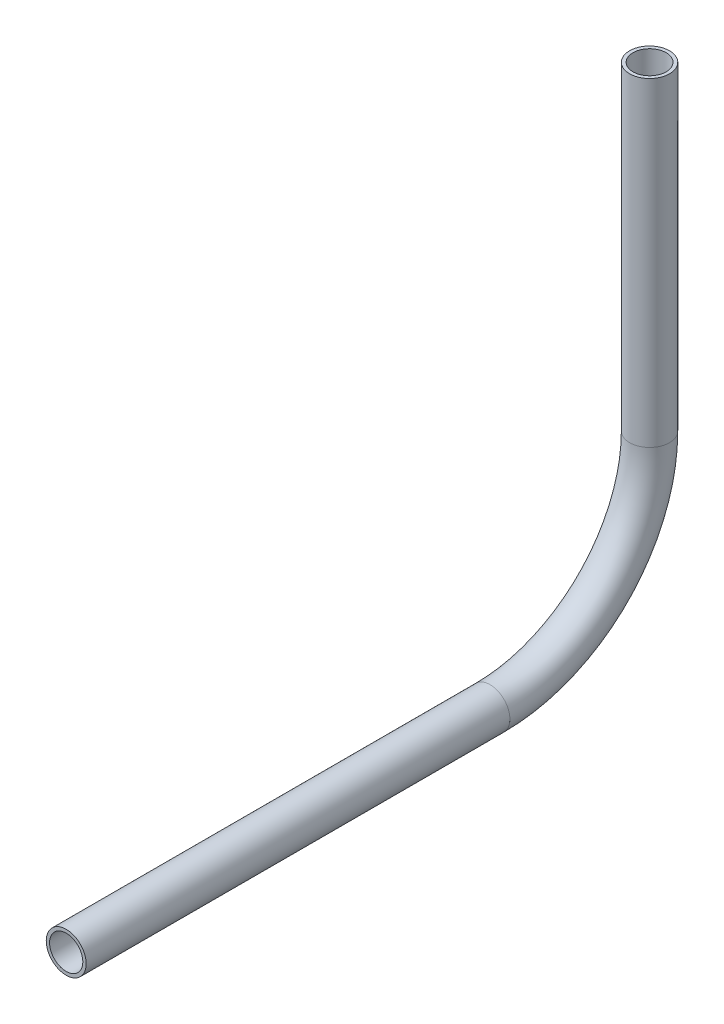
ISO-10303-21;
HEADER;
FILE_DESCRIPTION(('STEP AP214'),'2;1');
FILE_NAME('part.step','',(''),(''),'','','');
FILE_SCHEMA(('AUTOMOTIVE_DESIGN { 1 0 10303 214 1 1 1 1 }'));
ENDSEC;
DATA;
#1=APPLICATION_CONTEXT('core data for automotive mechanical design processes');
#2=APPLICATION_PROTOCOL_DEFINITION('international standard','automotive_design',2000,#1);
#3=PRODUCT_CONTEXT('',#1,'mechanical');
#4=PRODUCT('Part','Part','',(#3));
#5=PRODUCT_RELATED_PRODUCT_CATEGORY('part','',(#4));
#6=PRODUCT_DEFINITION_FORMATION('','',#4);
#7=PRODUCT_DEFINITION_CONTEXT('part definition',#1,'design');
#8=PRODUCT_DEFINITION('design','',#6,#7);
#9=PRODUCT_DEFINITION_SHAPE('','',#8);
#10=(LENGTH_UNIT() NAMED_UNIT(*) SI_UNIT(.MILLI.,.METRE.));
#11=(NAMED_UNIT(*) PLANE_ANGLE_UNIT() SI_UNIT($,.RADIAN.));
#12=(NAMED_UNIT(*) SI_UNIT($,.STERADIAN.) SOLID_ANGLE_UNIT());
#13=UNCERTAINTY_MEASURE_WITH_UNIT(LENGTH_MEASURE(1.E-05),#10,'distance_accuracy_value','');
#14=(GEOMETRIC_REPRESENTATION_CONTEXT(3) GLOBAL_UNCERTAINTY_ASSIGNED_CONTEXT((#13)) GLOBAL_UNIT_ASSIGNED_CONTEXT((#10,
#11,#12)) REPRESENTATION_CONTEXT('',''));
#15=CARTESIAN_POINT('',(0.,0.,0.));
#16=DIRECTION('',(0.,0.,1.));
#17=DIRECTION('',(1.,0.,0.));
#18=AXIS2_PLACEMENT_3D('',#15,#16,#17);
#19=CARTESIAN_POINT('',(0.,599.96001927236,168.273454593785));
#20=DIRECTION('',(0.,0.,1.));
#21=DIRECTION('',(1.,0.,0.));
#22=AXIS2_PLACEMENT_3D('',#19,#20,#21);
#23=CYLINDRICAL_SURFACE('',#22,5.28320000000004);
#24=CARTESIAN_POINT('',(0.,599.96001927236,303.16459571102));
#25=DIRECTION('',(0.,0.,-1.));
#26=DIRECTION('',(-1.,0.,0.));
#27=AXIS2_PLACEMENT_3D('',#24,#25,#26);
#28=CIRCLE('',#27,5.28320000000004);
#29=CARTESIAN_POINT('',(-5.28320000000004,599.96001927236,303.16459571102));
#30=VERTEX_POINT('',#29);
#31=EDGE_CURVE('E55',#30,#30,#28,.T.);
#32=ORIENTED_EDGE('',*,*,#31,.F.);
#33=EDGE_LOOP('',(#32));
#34=FACE_BOUND('',#33,.T.);
#35=CARTESIAN_POINT('',(0.,599.96001927236,168.273454593785));
#36=DIRECTION('',(0.,0.,-1.));
#37=DIRECTION('',(-1.,0.,0.));
#38=AXIS2_PLACEMENT_3D('',#35,#36,#37);
#39=CIRCLE('',#38,5.28320000000004);
#40=CARTESIAN_POINT('',(-5.28320000000004,599.96001927236,168.273454593785));
#41=VERTEX_POINT('',#40);
#42=EDGE_CURVE('E51',#41,#41,#39,.T.);
#43=ORIENTED_EDGE('',*,*,#42,.T.);
#44=EDGE_LOOP('',(#43));
#45=FACE_BOUND('',#44,.T.);
#46=ADVANCED_FACE('F47',(#34,#45),#23,.F.);
#47=CARTESIAN_POINT('',(0.,599.96001927236,168.273454593785));
#48=DIRECTION('',(0.,0.,1.));
#49=DIRECTION('',(1.,0.,0.));
#50=AXIS2_PLACEMENT_3D('',#47,#48,#49);
#51=CYLINDRICAL_SURFACE('',#50,6.35000000000005);
#52=CARTESIAN_POINT('',(0.,599.96001927236,303.16459571102));
#53=DIRECTION('',(0.,0.,-1.));
#54=DIRECTION('',(-1.,0.,0.));
#55=AXIS2_PLACEMENT_3D('',#52,#53,#54);
#56=CIRCLE('',#55,6.35000000000005);
#57=CARTESIAN_POINT('',(-6.35000000000005,599.96001927236,303.16459571102));
#58=VERTEX_POINT('',#57);
#59=EDGE_CURVE('E59',#58,#58,#56,.T.);
#60=ORIENTED_EDGE('',*,*,#59,.T.);
#61=EDGE_LOOP('',(#60));
#62=FACE_BOUND('',#61,.T.);
#63=CARTESIAN_POINT('',(0.,599.96001927236,168.273454593785));
#64=DIRECTION('',(0.,0.,-1.));
#65=DIRECTION('',(-1.,0.,0.));
#66=AXIS2_PLACEMENT_3D('',#63,#64,#65);
#67=CIRCLE('',#66,6.35000000000005);
#68=CARTESIAN_POINT('',(-6.35000000000005,599.96001927236,168.273454593785));
#69=VERTEX_POINT('',#68);
#70=EDGE_CURVE('E12',#69,#69,#67,.T.);
#71=ORIENTED_EDGE('',*,*,#70,.F.);
#72=EDGE_LOOP('',(#71));
#73=FACE_BOUND('',#72,.T.);
#74=ADVANCED_FACE('F74',(#62,#73),#51,.T.);
#75=CARTESIAN_POINT('',(0.,599.96001927236,303.16459571102));
#76=DIRECTION('',(0.,0.,-1.));
#77=DIRECTION('',(-1.,0.,0.));
#78=AXIS2_PLACEMENT_3D('',#75,#76,#77);
#79=PLANE('',#78);
#80=ORIENTED_EDGE('',*,*,#31,.T.);
#81=EDGE_LOOP('',(#80));
#82=FACE_BOUND('',#81,.T.);
#83=ORIENTED_EDGE('',*,*,#59,.F.);
#84=EDGE_LOOP('',(#83));
#85=FACE_BOUND('',#84,.T.);
#86=ADVANCED_FACE('F70',(#82,#85),#79,.F.);
#87=CARTESIAN_POINT('',(0.,599.96001927236,168.273454593785));
#88=DIRECTION('',(0.,0.,-1.));
#89=DIRECTION('',(-1.,0.,0.));
#90=AXIS2_PLACEMENT_3D('',#87,#88,#89);
#91=PLANE('',#90);
#92=ORIENTED_EDGE('',*,*,#42,.F.);
#93=EDGE_LOOP('',(#92));
#94=FACE_BOUND('',#93,.T.);
#95=ORIENTED_EDGE('',*,*,#70,.T.);
#96=EDGE_LOOP('',(#95));
#97=FACE_BOUND('',#96,.T.);
#98=ADVANCED_FACE('F49',(#94,#97),#91,.T.);
#99=CLOSED_SHELL('',(#46,#74,#86,#98));
#100=MANIFOLD_SOLID_BREP('B2',#99);
#101=CARTESIAN_POINT('',(0.,650.76001927236,168.273454593784));
#102=DIRECTION('',(-1.,0.,0.));
#103=DIRECTION('',(0.,0.,1.));
#104=AXIS2_PLACEMENT_3D('',#101,#102,#103);
#105=TOROIDAL_SURFACE('',#104,50.7999999999999,5.28320000000004);
#106=CARTESIAN_POINT('',(0.,650.760019272361,117.473454593784));
#107=DIRECTION('',(0.,1.,0.));
#108=DIRECTION('',(0.,0.,1.));
#109=AXIS2_PLACEMENT_3D('',#106,#107,#108);
#110=CIRCLE('',#109,5.28320000000004);
#111=CARTESIAN_POINT('',(0.,650.760019272361,112.190254593784));
#112=VERTEX_POINT('',#111);
#113=EDGE_CURVE('E150',#112,#112,#110,.T.);
#114=CARTESIAN_POINT('',(0.,599.96001927236,168.273454593784));
#115=DIRECTION('',(0.,0.,1.));
#116=DIRECTION('',(1.,0.,0.));
#117=AXIS2_PLACEMENT_3D('',#114,#115,#116);
#118=CIRCLE('',#117,5.28320000000004);
#119=CARTESIAN_POINT('',(0.,594.67681927236,168.273454593784));
#120=VERTEX_POINT('',#119);
#121=EDGE_CURVE('E140',#120,#120,#118,.T.);
#122=CARTESIAN_POINT('',(0.,650.76001927236,168.273454593784));
#123=DIRECTION('',(-1.,0.,0.));
#124=DIRECTION('',(0.,0.,1.));
#125=AXIS2_PLACEMENT_3D('',#122,#123,#124);
#126=CIRCLE('',#125,56.0832);
#127=EDGE_CURVE('',#112,#120,#126,.T.);
#128=ORIENTED_EDGE('',*,*,#113,.T.);
#129=ORIENTED_EDGE('',*,*,#121,.T.);
#130=ORIENTED_EDGE('',*,*,#127,.T.);
#131=ORIENTED_EDGE('',*,*,#127,.F.);
#132=EDGE_LOOP('',(#128,#130,#129,#131));
#133=FACE_BOUND('',#132,.T.);
#134=ADVANCED_FACE('F136',(#133),#105,.F.);
#135=CARTESIAN_POINT('',(0.,650.76001927236,168.273454593784));
#136=DIRECTION('',(-1.,0.,0.));
#137=DIRECTION('',(0.,0.,1.));
#138=AXIS2_PLACEMENT_3D('',#135,#136,#137);
#139=TOROIDAL_SURFACE('',#138,50.7999999999999,6.35000000000005);
#140=CARTESIAN_POINT('',(0.,650.760019272361,117.473454593784));
#141=DIRECTION('',(0.,1.,0.));
#142=DIRECTION('',(0.,0.,1.));
#143=AXIS2_PLACEMENT_3D('',#140,#141,#142);
#144=CIRCLE('',#143,6.35000000000005);
#145=CARTESIAN_POINT('',(0.,650.760019272361,111.123454593784));
#146=VERTEX_POINT('',#145);
#147=EDGE_CURVE('E144',#146,#146,#144,.T.);
#148=CARTESIAN_POINT('',(0.,599.96001927236,168.273454593784));
#149=DIRECTION('',(0.,0.,1.));
#150=DIRECTION('',(1.,0.,0.));
#151=AXIS2_PLACEMENT_3D('',#148,#149,#150);
#152=CIRCLE('',#151,6.35000000000005);
#153=CARTESIAN_POINT('',(0.,593.61001927236,168.273454593784));
#154=VERTEX_POINT('',#153);
#155=EDGE_CURVE('E46',#154,#154,#152,.T.);
#156=CARTESIAN_POINT('',(0.,650.76001927236,168.273454593784));
#157=DIRECTION('',(-1.,0.,0.));
#158=DIRECTION('',(0.,0.,1.));
#159=AXIS2_PLACEMENT_3D('',#156,#157,#158);
#160=CIRCLE('',#159,57.15);
#161=EDGE_CURVE('',#146,#154,#160,.T.);
#162=ORIENTED_EDGE('',*,*,#147,.F.);
#163=ORIENTED_EDGE('',*,*,#155,.F.);
#164=ORIENTED_EDGE('',*,*,#161,.T.);
#165=ORIENTED_EDGE('',*,*,#161,.F.);
#166=EDGE_LOOP('',(#162,#164,#163,#165));
#167=FACE_BOUND('',#166,.T.);
#168=ADVANCED_FACE('F163',(#167),#139,.T.);
#169=CARTESIAN_POINT('',(0.,650.76001927236,117.473454593784));
#170=DIRECTION('',(0.,1.,0.));
#171=DIRECTION('',(0.,0.,1.));
#172=AXIS2_PLACEMENT_3D('',#169,#170,#171);
#173=PLANE('',#172);
#174=ORIENTED_EDGE('',*,*,#113,.F.);
#175=EDGE_LOOP('',(#174));
#176=FACE_BOUND('',#175,.T.);
#177=ORIENTED_EDGE('',*,*,#147,.T.);
#178=EDGE_LOOP('',(#177));
#179=FACE_BOUND('',#178,.T.);
#180=ADVANCED_FACE('F159',(#176,#179),#173,.T.);
#181=CARTESIAN_POINT('',(0.,599.96001927236,168.273454593785));
#182=DIRECTION('',(0.,0.,1.));
#183=DIRECTION('',(1.,0.,0.));
#184=AXIS2_PLACEMENT_3D('',#181,#182,#183);
#185=PLANE('',#184);
#186=ORIENTED_EDGE('',*,*,#121,.F.);
#187=EDGE_LOOP('',(#186));
#188=FACE_BOUND('',#187,.T.);
#189=ORIENTED_EDGE('',*,*,#155,.T.);
#190=EDGE_LOOP('',(#189));
#191=FACE_BOUND('',#190,.T.);
#192=ADVANCED_FACE('F138',(#188,#191),#185,.T.);
#193=CLOSED_SHELL('',(#134,#168,#180,#192));
#194=MANIFOLD_SOLID_BREP('B7',#193);
#195=CARTESIAN_POINT('',(0.,752.458618261262,117.473454593784));
#196=DIRECTION('',(0.,-1.,0.));
#197=DIRECTION('',(0.,0.,-1.));
#198=AXIS2_PLACEMENT_3D('',#195,#196,#197);
#199=CYLINDRICAL_SURFACE('',#198,5.28320000000004);
#200=CARTESIAN_POINT('',(0.,752.458618261262,117.473454593784));
#201=DIRECTION('',(0.,1.,0.));
#202=DIRECTION('',(-1.,0.,0.));
#203=AXIS2_PLACEMENT_3D('',#200,#201,#202);
#204=CIRCLE('',#203,5.28320000000004);
#205=CARTESIAN_POINT('',(-5.28320000000004,752.458618261262,117.473454593784));
#206=VERTEX_POINT('',#205);
#207=EDGE_CURVE('E234',#206,#206,#204,.T.);
#208=ORIENTED_EDGE('',*,*,#207,.T.);
#209=EDGE_LOOP('',(#208));
#210=FACE_BOUND('',#209,.T.);
#211=CARTESIAN_POINT('',(0.,650.76001927236,117.473454593784));
#212=DIRECTION('',(0.,-1.,0.));
#213=DIRECTION('',(0.,0.,-1.));
#214=AXIS2_PLACEMENT_3D('',#211,#212,#213);
#215=CIRCLE('',#214,5.28320000000004);
#216=CARTESIAN_POINT('',(0.,650.76001927236,112.190254593784));
#217=VERTEX_POINT('',#216);
#218=EDGE_CURVE('E224',#217,#217,#215,.T.);
#219=ORIENTED_EDGE('',*,*,#218,.T.);
#220=EDGE_LOOP('',(#219));
#221=FACE_BOUND('',#220,.T.);
#222=ADVANCED_FACE('F220',(#210,#221),#199,.F.);
#223=CARTESIAN_POINT('',(0.,752.458618261262,117.473454593784));
#224=DIRECTION('',(0.,-1.,0.));
#225=DIRECTION('',(0.,0.,-1.));
#226=AXIS2_PLACEMENT_3D('',#223,#224,#225);
#227=CYLINDRICAL_SURFACE('',#226,6.35000000000005);
#228=CARTESIAN_POINT('',(0.,752.458618261262,117.473454593784));
#229=DIRECTION('',(0.,1.,0.));
#230=DIRECTION('',(-1.,0.,0.));
#231=AXIS2_PLACEMENT_3D('',#228,#229,#230);
#232=CIRCLE('',#231,6.35000000000005);
#233=CARTESIAN_POINT('',(-6.35000000000005,752.458618261262,117.473454593784));
#234=VERTEX_POINT('',#233);
#235=EDGE_CURVE('E228',#234,#234,#232,.T.);
#236=ORIENTED_EDGE('',*,*,#235,.F.);
#237=EDGE_LOOP('',(#236));
#238=FACE_BOUND('',#237,.T.);
#239=CARTESIAN_POINT('',(0.,650.76001927236,117.473454593784));
#240=DIRECTION('',(0.,-1.,0.));
#241=DIRECTION('',(0.,0.,-1.));
#242=AXIS2_PLACEMENT_3D('',#239,#240,#241);
#243=CIRCLE('',#242,6.35000000000005);
#244=CARTESIAN_POINT('',(0.,650.76001927236,111.123454593784));
#245=VERTEX_POINT('',#244);
#246=EDGE_CURVE('E135',#245,#245,#243,.T.);
#247=ORIENTED_EDGE('',*,*,#246,.F.);
#248=EDGE_LOOP('',(#247));
#249=FACE_BOUND('',#248,.T.);
#250=ADVANCED_FACE('F247',(#238,#249),#227,.T.);
#251=CARTESIAN_POINT('',(0.,752.458618261262,117.473454593784));
#252=DIRECTION('',(0.,1.,0.));
#253=DIRECTION('',(-1.,0.,0.));
#254=AXIS2_PLACEMENT_3D('',#251,#252,#253);
#255=PLANE('',#254);
#256=ORIENTED_EDGE('',*,*,#207,.F.);
#257=EDGE_LOOP('',(#256));
#258=FACE_BOUND('',#257,.T.);
#259=ORIENTED_EDGE('',*,*,#235,.T.);
#260=EDGE_LOOP('',(#259));
#261=FACE_BOUND('',#260,.T.);
#262=ADVANCED_FACE('F243',(#258,#261),#255,.T.);
#263=CARTESIAN_POINT('',(0.,650.76001927236,117.473454593784));
#264=DIRECTION('',(0.,-1.,0.));
#265=DIRECTION('',(0.,0.,-1.));
#266=AXIS2_PLACEMENT_3D('',#263,#264,#265);
#267=PLANE('',#266);
#268=ORIENTED_EDGE('',*,*,#218,.F.);
#269=EDGE_LOOP('',(#268));
#270=FACE_BOUND('',#269,.T.);
#271=ORIENTED_EDGE('',*,*,#246,.T.);
#272=EDGE_LOOP('',(#271));
#273=FACE_BOUND('',#272,.T.);
#274=ADVANCED_FACE('F222',(#270,#273),#267,.T.);
#275=CLOSED_SHELL('',(#222,#250,#262,#274));
#276=MANIFOLD_SOLID_BREP('B41',#275);
#277=ADVANCED_BREP_SHAPE_REPRESENTATION('',(#18,#100,#194,#276),#14);
#278=SHAPE_DEFINITION_REPRESENTATION(#9,#277);
ENDSEC;
END-ISO-10303-21;
